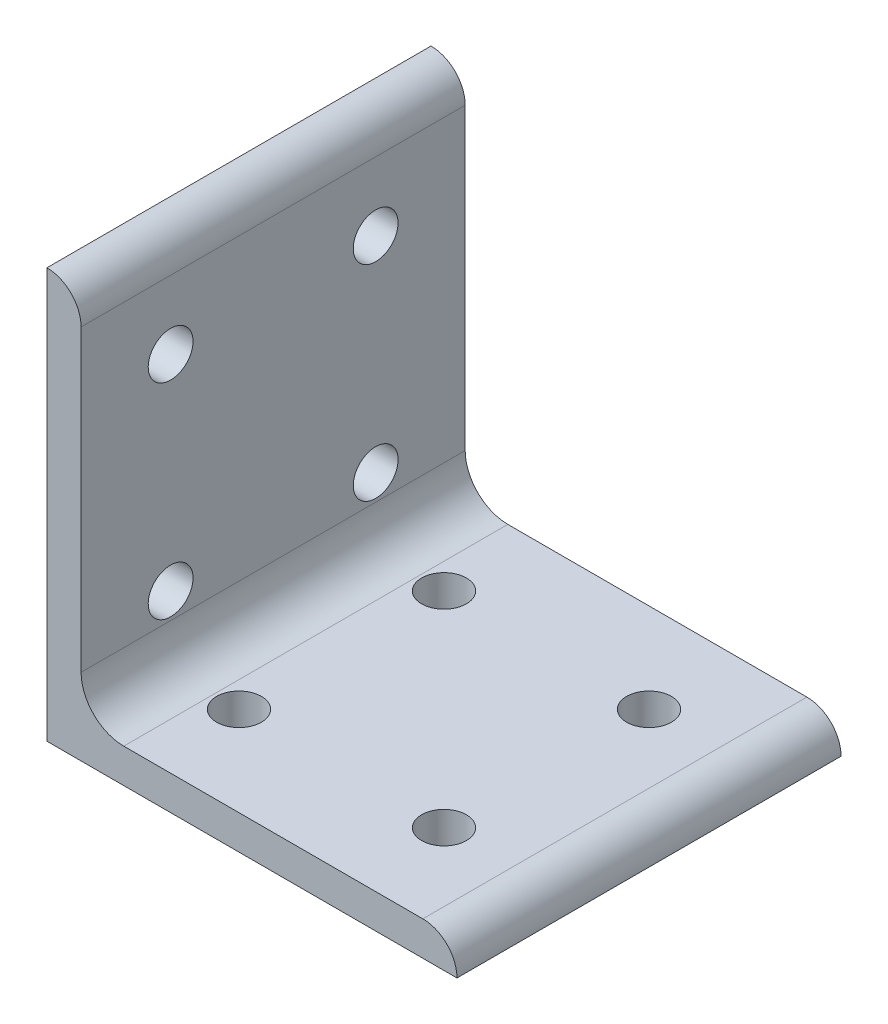
ISO-10303-21;
HEADER;
FILE_DESCRIPTION(('STEP AP214'),'2;1');
FILE_NAME('part.step','',(''),(''),'','','');
FILE_SCHEMA(('AUTOMOTIVE_DESIGN { 1 0 10303 214 1 1 1 1 }'));
ENDSEC;
DATA;
#1=APPLICATION_CONTEXT('core data for automotive mechanical design processes');
#2=APPLICATION_PROTOCOL_DEFINITION('international standard','automotive_design',2000,#1);
#3=PRODUCT_CONTEXT('',#1,'mechanical');
#4=PRODUCT('Part','Part','',(#3));
#5=PRODUCT_RELATED_PRODUCT_CATEGORY('part','',(#4));
#6=PRODUCT_DEFINITION_FORMATION('','',#4);
#7=PRODUCT_DEFINITION_CONTEXT('part definition',#1,'design');
#8=PRODUCT_DEFINITION('design','',#6,#7);
#9=PRODUCT_DEFINITION_SHAPE('','',#8);
#10=(LENGTH_UNIT() NAMED_UNIT(*) SI_UNIT(.MILLI.,.METRE.));
#11=(NAMED_UNIT(*) PLANE_ANGLE_UNIT() SI_UNIT($,.RADIAN.));
#12=(NAMED_UNIT(*) SI_UNIT($,.STERADIAN.) SOLID_ANGLE_UNIT());
#13=UNCERTAINTY_MEASURE_WITH_UNIT(LENGTH_MEASURE(1.E-05),#10,'distance_accuracy_value','');
#14=(GEOMETRIC_REPRESENTATION_CONTEXT(3) GLOBAL_UNCERTAINTY_ASSIGNED_CONTEXT((#13)) GLOBAL_UNIT_ASSIGNED_CONTEXT((#10,
#11,#12)) REPRESENTATION_CONTEXT('',''));
#15=CARTESIAN_POINT('',(0.,0.,0.));
#16=DIRECTION('',(0.,0.,1.));
#17=DIRECTION('',(1.,0.,0.));
#18=AXIS2_PLACEMENT_3D('',#15,#16,#17);
#19=CARTESIAN_POINT('',(6.35,69.85,35.687));
#20=DIRECTION('',(-1.,0.,0.));
#21=DIRECTION('',(0.,-1.,0.));
#22=AXIS2_PLACEMENT_3D('',#19,#20,#21);
#23=PLANE('',#22);
#24=DIRECTION('',(0.,1.,0.));
#25=VECTOR('',#24,1.);
#26=CARTESIAN_POINT('',(6.35,69.85,-35.687));
#27=LINE('',#26,#25);
#28=CARTESIAN_POINT('',(6.35,14.2748,-35.687));
#29=VERTEX_POINT('',#28);
#30=CARTESIAN_POINT('',(6.35,69.85,-35.687));
#31=VERTEX_POINT('',#30);
#32=EDGE_CURVE('E117',#29,#31,#27,.T.);
#33=ORIENTED_EDGE('',*,*,#32,.T.);
#34=DIRECTION('',(0.,0.,-1.));
#35=VECTOR('',#34,1.);
#36=CARTESIAN_POINT('',(6.35,69.85,35.687));
#37=LINE('',#36,#35);
#38=CARTESIAN_POINT('',(6.35,69.85,35.687));
#39=VERTEX_POINT('',#38);
#40=EDGE_CURVE('E114',#39,#31,#37,.T.);
#41=ORIENTED_EDGE('',*,*,#40,.F.);
#42=DIRECTION('',(0.,1.,0.));
#43=VECTOR('',#42,1.);
#44=CARTESIAN_POINT('',(6.35,69.85,35.687));
#45=LINE('',#44,#43);
#46=CARTESIAN_POINT('',(6.35,14.2748,35.687));
#47=VERTEX_POINT('',#46);
#48=EDGE_CURVE('E103',#47,#39,#45,.T.);
#49=ORIENTED_EDGE('',*,*,#48,.F.);
#50=DIRECTION('',(0.,0.,-1.));
#51=VECTOR('',#50,1.);
#52=CARTESIAN_POINT('',(6.35,14.2748,35.687));
#53=LINE('',#52,#51);
#54=EDGE_CURVE('E118',#47,#29,#53,.T.);
#55=ORIENTED_EDGE('',*,*,#54,.T.);
#56=EDGE_LOOP('',(#33,#41,#49,#55));
#57=FACE_BOUND('',#56,.T.);
#58=CARTESIAN_POINT('',(6.34999999999999,19.05,19.05));
#59=DIRECTION('',(-1.,0.,0.));
#60=DIRECTION('',(0.,-1.,0.));
#61=AXIS2_PLACEMENT_3D('',#58,#59,#60);
#62=CIRCLE('',#61,4.1656);
#63=CARTESIAN_POINT('',(6.35,14.8844,19.05));
#64=VERTEX_POINT('',#63);
#65=EDGE_CURVE('E225',#64,#64,#62,.F.);
#66=ORIENTED_EDGE('',*,*,#65,.F.);
#67=EDGE_LOOP('',(#66));
#68=FACE_BOUND('',#67,.T.);
#69=CARTESIAN_POINT('',(6.34999999999999,57.15,19.05));
#70=DIRECTION('',(-1.,0.,0.));
#71=DIRECTION('',(0.,-1.,0.));
#72=AXIS2_PLACEMENT_3D('',#69,#70,#71);
#73=CIRCLE('',#72,4.1656);
#74=CARTESIAN_POINT('',(6.35,52.9844,19.05));
#75=VERTEX_POINT('',#74);
#76=EDGE_CURVE('E222',#75,#75,#73,.F.);
#77=ORIENTED_EDGE('',*,*,#76,.F.);
#78=EDGE_LOOP('',(#77));
#79=FACE_BOUND('',#78,.T.);
#80=CARTESIAN_POINT('',(6.34999999999999,19.05,-19.05));
#81=DIRECTION('',(-1.,0.,0.));
#82=DIRECTION('',(0.,-1.,0.));
#83=AXIS2_PLACEMENT_3D('',#80,#81,#82);
#84=CIRCLE('',#83,4.1656);
#85=CARTESIAN_POINT('',(6.35,14.8844,-19.05));
#86=VERTEX_POINT('',#85);
#87=EDGE_CURVE('E218',#86,#86,#84,.F.);
#88=ORIENTED_EDGE('',*,*,#87,.F.);
#89=EDGE_LOOP('',(#88));
#90=FACE_BOUND('',#89,.T.);
#91=CARTESIAN_POINT('',(6.34999999999999,57.15,-19.05));
#92=DIRECTION('',(-1.,0.,0.));
#93=DIRECTION('',(0.,-1.,0.));
#94=AXIS2_PLACEMENT_3D('',#91,#92,#93);
#95=CIRCLE('',#94,4.1656);
#96=CARTESIAN_POINT('',(6.35,52.9844,-19.05));
#97=VERTEX_POINT('',#96);
#98=EDGE_CURVE('E212',#97,#97,#95,.F.);
#99=ORIENTED_EDGE('',*,*,#98,.F.);
#100=EDGE_LOOP('',(#99));
#101=FACE_BOUND('',#100,.T.);
#102=ADVANCED_FACE('F34',(#57,#68,#79,#90,#101),#23,.F.);
#103=CARTESIAN_POINT('',(0.,0.,35.687));
#104=DIRECTION('',(1.,0.,0.));
#105=DIRECTION('',(0.,0.,-1.));
#106=AXIS2_PLACEMENT_3D('',#103,#104,#105);
#107=PLANE('',#106);
#108=DIRECTION('',(0.,-1.,0.));
#109=VECTOR('',#108,1.);
#110=CARTESIAN_POINT('',(0.,0.,-35.687));
#111=LINE('',#110,#109);
#112=CARTESIAN_POINT('',(0.,76.2,-35.687));
#113=VERTEX_POINT('',#112);
#114=CARTESIAN_POINT('',(0.,0.,-35.687));
#115=VERTEX_POINT('',#114);
#116=EDGE_CURVE('E85',#113,#115,#111,.T.);
#117=ORIENTED_EDGE('',*,*,#116,.T.);
#118=DIRECTION('',(0.,0.,-1.));
#119=VECTOR('',#118,1.);
#120=CARTESIAN_POINT('',(0.,0.,35.687));
#121=LINE('',#120,#119);
#122=CARTESIAN_POINT('',(0.,0.,35.687));
#123=VERTEX_POINT('',#122);
#124=EDGE_CURVE('E123',#123,#115,#121,.T.);
#125=ORIENTED_EDGE('',*,*,#124,.F.);
#126=DIRECTION('',(0.,-1.,0.));
#127=VECTOR('',#126,1.);
#128=CARTESIAN_POINT('',(0.,0.,35.687));
#129=LINE('',#128,#127);
#130=CARTESIAN_POINT('',(0.,76.2,35.687));
#131=VERTEX_POINT('',#130);
#132=EDGE_CURVE('E53',#131,#123,#129,.T.);
#133=ORIENTED_EDGE('',*,*,#132,.F.);
#134=DIRECTION('',(0.,0.,-1.));
#135=VECTOR('',#134,1.);
#136=CARTESIAN_POINT('',(0.,76.2,35.687));
#137=LINE('',#136,#135);
#138=EDGE_CURVE('E119',#131,#113,#137,.T.);
#139=ORIENTED_EDGE('',*,*,#138,.T.);
#140=EDGE_LOOP('',(#117,#125,#133,#139));
#141=FACE_BOUND('',#140,.T.);
#142=CARTESIAN_POINT('',(0.,19.05,19.05));
#143=DIRECTION('',(1.,0.,0.));
#144=DIRECTION('',(0.,0.,-1.));
#145=AXIS2_PLACEMENT_3D('',#142,#143,#144);
#146=CIRCLE('',#145,4.1656);
#147=CARTESIAN_POINT('',(0.,19.05,14.8844));
#148=VERTEX_POINT('',#147);
#149=EDGE_CURVE('E199',#148,#148,#146,.T.);
#150=ORIENTED_EDGE('',*,*,#149,.T.);
#151=EDGE_LOOP('',(#150));
#152=FACE_BOUND('',#151,.T.);
#153=CARTESIAN_POINT('',(0.,57.15,19.05));
#154=DIRECTION('',(1.,0.,0.));
#155=DIRECTION('',(0.,0.,-1.));
#156=AXIS2_PLACEMENT_3D('',#153,#154,#155);
#157=CIRCLE('',#156,4.1656);
#158=CARTESIAN_POINT('',(0.,57.15,14.8844));
#159=VERTEX_POINT('',#158);
#160=EDGE_CURVE('E203',#159,#159,#157,.T.);
#161=ORIENTED_EDGE('',*,*,#160,.T.);
#162=EDGE_LOOP('',(#161));
#163=FACE_BOUND('',#162,.T.);
#164=CARTESIAN_POINT('',(0.,19.05,-19.05));
#165=DIRECTION('',(1.,0.,0.));
#166=DIRECTION('',(0.,0.,-1.));
#167=AXIS2_PLACEMENT_3D('',#164,#165,#166);
#168=CIRCLE('',#167,4.1656);
#169=CARTESIAN_POINT('',(0.,19.05,-23.2156));
#170=VERTEX_POINT('',#169);
#171=EDGE_CURVE('E207',#170,#170,#168,.T.);
#172=ORIENTED_EDGE('',*,*,#171,.T.);
#173=EDGE_LOOP('',(#172));
#174=FACE_BOUND('',#173,.T.);
#175=CARTESIAN_POINT('',(0.,57.15,-19.05));
#176=DIRECTION('',(1.,0.,0.));
#177=DIRECTION('',(0.,0.,-1.));
#178=AXIS2_PLACEMENT_3D('',#175,#176,#177);
#179=CIRCLE('',#178,4.1656);
#180=CARTESIAN_POINT('',(0.,57.15,-23.2156));
#181=VERTEX_POINT('',#180);
#182=EDGE_CURVE('E210',#181,#181,#179,.T.);
#183=ORIENTED_EDGE('',*,*,#182,.T.);
#184=EDGE_LOOP('',(#183));
#185=FACE_BOUND('',#184,.T.);
#186=ADVANCED_FACE('F192',(#141,#152,#163,#174,#185),#107,.F.);
#187=CARTESIAN_POINT('',(76.2,0.,35.687));
#188=DIRECTION('',(0.,1.,0.));
#189=DIRECTION('',(-1.,0.,0.));
#190=AXIS2_PLACEMENT_3D('',#187,#188,#189);
#191=PLANE('',#190);
#192=DIRECTION('',(1.,0.,0.));
#193=VECTOR('',#192,1.);
#194=CARTESIAN_POINT('',(76.2,0.,-35.687));
#195=LINE('',#194,#193);
#196=CARTESIAN_POINT('',(76.2,0.,-35.687));
#197=VERTEX_POINT('',#196);
#198=EDGE_CURVE('E127',#115,#197,#195,.T.);
#199=ORIENTED_EDGE('',*,*,#198,.T.);
#200=DIRECTION('',(0.,0.,-1.));
#201=VECTOR('',#200,1.);
#202=CARTESIAN_POINT('',(76.2,0.,35.687));
#203=LINE('',#202,#201);
#204=CARTESIAN_POINT('',(76.2,0.,35.687));
#205=VERTEX_POINT('',#204);
#206=EDGE_CURVE('E11',#205,#197,#203,.T.);
#207=ORIENTED_EDGE('',*,*,#206,.F.);
#208=DIRECTION('',(1.,0.,0.));
#209=VECTOR('',#208,1.);
#210=CARTESIAN_POINT('',(76.2,0.,35.687));
#211=LINE('',#210,#209);
#212=EDGE_CURVE('E140',#123,#205,#211,.T.);
#213=ORIENTED_EDGE('',*,*,#212,.F.);
#214=ORIENTED_EDGE('',*,*,#124,.T.);
#215=EDGE_LOOP('',(#199,#207,#213,#214));
#216=FACE_BOUND('',#215,.T.);
#217=CARTESIAN_POINT('',(19.05,0.,19.05));
#218=DIRECTION('',(0.,1.,0.));
#219=DIRECTION('',(0.,0.,1.));
#220=AXIS2_PLACEMENT_3D('',#217,#218,#219);
#221=CIRCLE('',#220,4.1656);
#222=CARTESIAN_POINT('',(19.05,0.,23.2156));
#223=VERTEX_POINT('',#222);
#224=EDGE_CURVE('E151',#223,#223,#221,.T.);
#225=ORIENTED_EDGE('',*,*,#224,.T.);
#226=EDGE_LOOP('',(#225));
#227=FACE_BOUND('',#226,.T.);
#228=CARTESIAN_POINT('',(57.15,0.,19.05));
#229=DIRECTION('',(0.,1.,0.));
#230=DIRECTION('',(0.,0.,1.));
#231=AXIS2_PLACEMENT_3D('',#228,#229,#230);
#232=CIRCLE('',#231,4.1656);
#233=CARTESIAN_POINT('',(57.15,0.,23.2156));
#234=VERTEX_POINT('',#233);
#235=EDGE_CURVE('E154',#234,#234,#232,.T.);
#236=ORIENTED_EDGE('',*,*,#235,.T.);
#237=EDGE_LOOP('',(#236));
#238=FACE_BOUND('',#237,.T.);
#239=CARTESIAN_POINT('',(19.05,0.,-19.05));
#240=DIRECTION('',(0.,1.,0.));
#241=DIRECTION('',(0.,0.,1.));
#242=AXIS2_PLACEMENT_3D('',#239,#240,#241);
#243=CIRCLE('',#242,4.1656);
#244=CARTESIAN_POINT('',(19.05,0.,-14.8844));
#245=VERTEX_POINT('',#244);
#246=EDGE_CURVE('E157',#245,#245,#243,.T.);
#247=ORIENTED_EDGE('',*,*,#246,.T.);
#248=EDGE_LOOP('',(#247));
#249=FACE_BOUND('',#248,.T.);
#250=CARTESIAN_POINT('',(57.15,0.,-19.05));
#251=DIRECTION('',(0.,1.,0.));
#252=DIRECTION('',(0.,0.,1.));
#253=AXIS2_PLACEMENT_3D('',#250,#251,#252);
#254=CIRCLE('',#253,4.1656);
#255=CARTESIAN_POINT('',(57.15,0.,-14.8844));
#256=VERTEX_POINT('',#255);
#257=EDGE_CURVE('E167',#256,#256,#254,.T.);
#258=ORIENTED_EDGE('',*,*,#257,.T.);
#259=EDGE_LOOP('',(#258));
#260=FACE_BOUND('',#259,.T.);
#261=ADVANCED_FACE('F36',(#216,#227,#238,#249,#260),#191,.F.);
#262=CARTESIAN_POINT('',(14.2748,6.35,35.687));
#263=DIRECTION('',(0.,-1.,0.));
#264=DIRECTION('',(1.,0.,0.));
#265=AXIS2_PLACEMENT_3D('',#262,#263,#264);
#266=PLANE('',#265);
#267=DIRECTION('',(-1.,0.,0.));
#268=VECTOR('',#267,1.);
#269=CARTESIAN_POINT('',(14.2748,6.35,-35.687));
#270=LINE('',#269,#268);
#271=CARTESIAN_POINT('',(69.85,6.35,-35.687));
#272=VERTEX_POINT('',#271);
#273=CARTESIAN_POINT('',(14.2748,6.35,-35.687));
#274=VERTEX_POINT('',#273);
#275=EDGE_CURVE('E133',#272,#274,#270,.T.);
#276=ORIENTED_EDGE('',*,*,#275,.T.);
#277=DIRECTION('',(0.,0.,-1.));
#278=VECTOR('',#277,1.);
#279=CARTESIAN_POINT('',(14.2748,6.35,35.687));
#280=LINE('',#279,#278);
#281=CARTESIAN_POINT('',(14.2748,6.35,35.687));
#282=VERTEX_POINT('',#281);
#283=EDGE_CURVE('E144',#282,#274,#280,.T.);
#284=ORIENTED_EDGE('',*,*,#283,.F.);
#285=DIRECTION('',(-1.,0.,0.));
#286=VECTOR('',#285,1.);
#287=CARTESIAN_POINT('',(14.2748,6.35,35.687));
#288=LINE('',#287,#286);
#289=CARTESIAN_POINT('',(69.85,6.35,35.687));
#290=VERTEX_POINT('',#289);
#291=EDGE_CURVE('E175',#290,#282,#288,.T.);
#292=ORIENTED_EDGE('',*,*,#291,.F.);
#293=DIRECTION('',(0.,0.,-1.));
#294=VECTOR('',#293,1.);
#295=CARTESIAN_POINT('',(69.85,6.35,35.687));
#296=LINE('',#295,#294);
#297=EDGE_CURVE('E44',#290,#272,#296,.T.);
#298=ORIENTED_EDGE('',*,*,#297,.T.);
#299=EDGE_LOOP('',(#276,#284,#292,#298));
#300=FACE_BOUND('',#299,.T.);
#301=CARTESIAN_POINT('',(19.05,6.35000000000001,19.05));
#302=DIRECTION('',(0.,-1.,0.));
#303=DIRECTION('',(1.,0.,0.));
#304=AXIS2_PLACEMENT_3D('',#301,#302,#303);
#305=CIRCLE('',#304,4.1656);
#306=CARTESIAN_POINT('',(23.2156,6.35000000000001,19.05));
#307=VERTEX_POINT('',#306);
#308=EDGE_CURVE('E131',#307,#307,#305,.F.);
#309=ORIENTED_EDGE('',*,*,#308,.F.);
#310=EDGE_LOOP('',(#309));
#311=FACE_BOUND('',#310,.T.);
#312=CARTESIAN_POINT('',(57.15,6.35000000000001,19.05));
#313=DIRECTION('',(0.,-1.,0.));
#314=DIRECTION('',(1.,0.,0.));
#315=AXIS2_PLACEMENT_3D('',#312,#313,#314);
#316=CIRCLE('',#315,4.1656);
#317=CARTESIAN_POINT('',(61.3156,6.35000000000001,19.05));
#318=VERTEX_POINT('',#317);
#319=EDGE_CURVE('E152',#318,#318,#316,.F.);
#320=ORIENTED_EDGE('',*,*,#319,.F.);
#321=EDGE_LOOP('',(#320));
#322=FACE_BOUND('',#321,.T.);
#323=CARTESIAN_POINT('',(19.05,6.35000000000001,-19.05));
#324=DIRECTION('',(0.,-1.,0.));
#325=DIRECTION('',(1.,0.,0.));
#326=AXIS2_PLACEMENT_3D('',#323,#324,#325);
#327=CIRCLE('',#326,4.1656);
#328=CARTESIAN_POINT('',(23.2156,6.35000000000001,-19.05));
#329=VERTEX_POINT('',#328);
#330=EDGE_CURVE('E155',#329,#329,#327,.F.);
#331=ORIENTED_EDGE('',*,*,#330,.F.);
#332=EDGE_LOOP('',(#331));
#333=FACE_BOUND('',#332,.T.);
#334=CARTESIAN_POINT('',(57.15,6.35000000000001,-19.05));
#335=DIRECTION('',(0.,-1.,0.));
#336=DIRECTION('',(1.,0.,0.));
#337=AXIS2_PLACEMENT_3D('',#334,#335,#336);
#338=CIRCLE('',#337,4.1656);
#339=CARTESIAN_POINT('',(61.3156,6.35000000000001,-19.05));
#340=VERTEX_POINT('',#339);
#341=EDGE_CURVE('E38',#340,#340,#338,.F.);
#342=ORIENTED_EDGE('',*,*,#341,.F.);
#343=EDGE_LOOP('',(#342));
#344=FACE_BOUND('',#343,.T.);
#345=ADVANCED_FACE('F179',(#300,#311,#322,#333,#344),#266,.F.);
#346=CARTESIAN_POINT('',(69.85,0.,35.687));
#347=DIRECTION('',(0.,0.,-1.));
#348=DIRECTION('',(-1.,0.,0.));
#349=AXIS2_PLACEMENT_3D('',#346,#347,#348);
#350=CYLINDRICAL_SURFACE('',#349,6.35000000000001);
#351=CARTESIAN_POINT('',(69.85,0.,-35.687));
#352=DIRECTION('',(0.,0.,1.));
#353=DIRECTION('',(1.,0.,0.));
#354=AXIS2_PLACEMENT_3D('',#351,#352,#353);
#355=CIRCLE('',#354,6.35000000000001);
#356=EDGE_CURVE('E130',#197,#272,#355,.T.);
#357=ORIENTED_EDGE('',*,*,#356,.T.);
#358=ORIENTED_EDGE('',*,*,#297,.F.);
#359=CARTESIAN_POINT('',(69.85,0.,35.687));
#360=DIRECTION('',(0.,0.,1.));
#361=DIRECTION('',(1.,0.,0.));
#362=AXIS2_PLACEMENT_3D('',#359,#360,#361);
#363=CIRCLE('',#362,6.35000000000001);
#364=EDGE_CURVE('E93',#205,#290,#363,.T.);
#365=ORIENTED_EDGE('',*,*,#364,.F.);
#366=ORIENTED_EDGE('',*,*,#206,.T.);
#367=EDGE_LOOP('',(#357,#358,#365,#366));
#368=FACE_BOUND('',#367,.T.);
#369=ADVANCED_FACE('F242',(#368),#350,.T.);
#370=CARTESIAN_POINT('',(14.2748,14.2748,35.687));
#371=DIRECTION('',(0.,0.,-1.));
#372=DIRECTION('',(-1.,0.,0.));
#373=AXIS2_PLACEMENT_3D('',#370,#371,#372);
#374=CYLINDRICAL_SURFACE('',#373,7.9248);
#375=CARTESIAN_POINT('',(14.2748,14.2748,-35.687));
#376=DIRECTION('',(0.,0.,-1.));
#377=DIRECTION('',(1.,0.,0.));
#378=AXIS2_PLACEMENT_3D('',#375,#376,#377);
#379=CIRCLE('',#378,7.9248);
#380=EDGE_CURVE('E135',#274,#29,#379,.T.);
#381=ORIENTED_EDGE('',*,*,#380,.T.);
#382=ORIENTED_EDGE('',*,*,#54,.F.);
#383=CARTESIAN_POINT('',(14.2748,14.2748,35.687));
#384=DIRECTION('',(0.,0.,-1.));
#385=DIRECTION('',(1.,0.,0.));
#386=AXIS2_PLACEMENT_3D('',#383,#384,#385);
#387=CIRCLE('',#386,7.9248);
#388=EDGE_CURVE('E109',#282,#47,#387,.T.);
#389=ORIENTED_EDGE('',*,*,#388,.F.);
#390=ORIENTED_EDGE('',*,*,#283,.T.);
#391=EDGE_LOOP('',(#381,#382,#389,#390));
#392=FACE_BOUND('',#391,.T.);
#393=ADVANCED_FACE('F184',(#392),#374,.F.);
#394=CARTESIAN_POINT('',(0.,69.85,35.687));
#395=DIRECTION('',(0.,0.,-1.));
#396=DIRECTION('',(-1.,0.,0.));
#397=AXIS2_PLACEMENT_3D('',#394,#395,#396);
#398=CYLINDRICAL_SURFACE('',#397,6.35000000000001);
#399=CARTESIAN_POINT('',(0.,69.85,-35.687));
#400=DIRECTION('',(0.,0.,1.));
#401=DIRECTION('',(1.,0.,0.));
#402=AXIS2_PLACEMENT_3D('',#399,#400,#401);
#403=CIRCLE('',#402,6.35000000000001);
#404=EDGE_CURVE('E79',#31,#113,#403,.T.);
#405=ORIENTED_EDGE('',*,*,#404,.T.);
#406=ORIENTED_EDGE('',*,*,#138,.F.);
#407=CARTESIAN_POINT('',(0.,69.85,35.687));
#408=DIRECTION('',(0.,0.,1.));
#409=DIRECTION('',(1.,0.,0.));
#410=AXIS2_PLACEMENT_3D('',#407,#408,#409);
#411=CIRCLE('',#410,6.35000000000001);
#412=EDGE_CURVE('E107',#39,#131,#411,.T.);
#413=ORIENTED_EDGE('',*,*,#412,.F.);
#414=ORIENTED_EDGE('',*,*,#40,.T.);
#415=EDGE_LOOP('',(#405,#406,#413,#414));
#416=FACE_BOUND('',#415,.T.);
#417=ADVANCED_FACE('F121',(#416),#398,.T.);
#418=CARTESIAN_POINT('',(0.,69.85,35.687));
#419=DIRECTION('',(0.,0.,1.));
#420=DIRECTION('',(1.,0.,0.));
#421=AXIS2_PLACEMENT_3D('',#418,#419,#420);
#422=PLANE('',#421);
#423=ORIENTED_EDGE('',*,*,#212,.T.);
#424=ORIENTED_EDGE('',*,*,#364,.T.);
#425=ORIENTED_EDGE('',*,*,#291,.T.);
#426=ORIENTED_EDGE('',*,*,#388,.T.);
#427=ORIENTED_EDGE('',*,*,#48,.T.);
#428=ORIENTED_EDGE('',*,*,#412,.T.);
#429=ORIENTED_EDGE('',*,*,#132,.T.);
#430=EDGE_LOOP('',(#423,#424,#425,#426,#427,#428,#429));
#431=FACE_BOUND('',#430,.T.);
#432=ADVANCED_FACE('F105',(#431),#422,.T.);
#433=CARTESIAN_POINT('',(0.,69.85,-35.687));
#434=DIRECTION('',(0.,0.,1.));
#435=DIRECTION('',(1.,0.,0.));
#436=AXIS2_PLACEMENT_3D('',#433,#434,#435);
#437=PLANE('',#436);
#438=ORIENTED_EDGE('',*,*,#198,.F.);
#439=ORIENTED_EDGE('',*,*,#116,.F.);
#440=ORIENTED_EDGE('',*,*,#404,.F.);
#441=ORIENTED_EDGE('',*,*,#32,.F.);
#442=ORIENTED_EDGE('',*,*,#380,.F.);
#443=ORIENTED_EDGE('',*,*,#275,.F.);
#444=ORIENTED_EDGE('',*,*,#356,.F.);
#445=EDGE_LOOP('',(#438,#439,#440,#441,#442,#443,#444));
#446=FACE_BOUND('',#445,.T.);
#447=ADVANCED_FACE('F187',(#446),#437,.F.);
#448=CARTESIAN_POINT('',(19.05,76.2,19.05));
#449=DIRECTION('',(0.,-1.,0.));
#450=DIRECTION('',(0.,0.,-1.));
#451=AXIS2_PLACEMENT_3D('',#448,#449,#450);
#452=CYLINDRICAL_SURFACE('',#451,4.1656);
#453=ORIENTED_EDGE('',*,*,#224,.F.);
#454=EDGE_LOOP('',(#453));
#455=FACE_BOUND('',#454,.T.);
#456=ORIENTED_EDGE('',*,*,#308,.T.);
#457=EDGE_LOOP('',(#456));
#458=FACE_BOUND('',#457,.T.);
#459=ADVANCED_FACE('F265',(#455,#458),#452,.F.);
#460=CARTESIAN_POINT('',(57.15,76.2,19.05));
#461=DIRECTION('',(0.,-1.,0.));
#462=DIRECTION('',(0.,0.,-1.));
#463=AXIS2_PLACEMENT_3D('',#460,#461,#462);
#464=CYLINDRICAL_SURFACE('',#463,4.1656);
#465=ORIENTED_EDGE('',*,*,#235,.F.);
#466=EDGE_LOOP('',(#465));
#467=FACE_BOUND('',#466,.T.);
#468=ORIENTED_EDGE('',*,*,#319,.T.);
#469=EDGE_LOOP('',(#468));
#470=FACE_BOUND('',#469,.T.);
#471=ADVANCED_FACE('F270',(#467,#470),#464,.F.);
#472=CARTESIAN_POINT('',(19.05,76.2,-19.05));
#473=DIRECTION('',(0.,-1.,0.));
#474=DIRECTION('',(0.,0.,-1.));
#475=AXIS2_PLACEMENT_3D('',#472,#473,#474);
#476=CYLINDRICAL_SURFACE('',#475,4.1656);
#477=ORIENTED_EDGE('',*,*,#246,.F.);
#478=EDGE_LOOP('',(#477));
#479=FACE_BOUND('',#478,.T.);
#480=ORIENTED_EDGE('',*,*,#330,.T.);
#481=EDGE_LOOP('',(#480));
#482=FACE_BOUND('',#481,.T.);
#483=ADVANCED_FACE('F237',(#479,#482),#476,.F.);
#484=CARTESIAN_POINT('',(57.15,76.2,-19.05));
#485=DIRECTION('',(0.,-1.,0.));
#486=DIRECTION('',(0.,0.,-1.));
#487=AXIS2_PLACEMENT_3D('',#484,#485,#486);
#488=CYLINDRICAL_SURFACE('',#487,4.1656);
#489=ORIENTED_EDGE('',*,*,#257,.F.);
#490=EDGE_LOOP('',(#489));
#491=FACE_BOUND('',#490,.T.);
#492=ORIENTED_EDGE('',*,*,#341,.T.);
#493=EDGE_LOOP('',(#492));
#494=FACE_BOUND('',#493,.T.);
#495=ADVANCED_FACE('F233',(#491,#494),#488,.F.);
#496=CARTESIAN_POINT('',(76.2,19.05,19.05));
#497=DIRECTION('',(-1.,0.,0.));
#498=DIRECTION('',(0.,0.,1.));
#499=AXIS2_PLACEMENT_3D('',#496,#497,#498);
#500=CYLINDRICAL_SURFACE('',#499,4.1656);
#501=ORIENTED_EDGE('',*,*,#149,.F.);
#502=EDGE_LOOP('',(#501));
#503=FACE_BOUND('',#502,.T.);
#504=ORIENTED_EDGE('',*,*,#65,.T.);
#505=EDGE_LOOP('',(#504));
#506=FACE_BOUND('',#505,.T.);
#507=ADVANCED_FACE('F236',(#503,#506),#500,.F.);
#508=CARTESIAN_POINT('',(76.2,57.15,19.05));
#509=DIRECTION('',(-1.,0.,0.));
#510=DIRECTION('',(0.,0.,1.));
#511=AXIS2_PLACEMENT_3D('',#508,#509,#510);
#512=CYLINDRICAL_SURFACE('',#511,4.1656);
#513=ORIENTED_EDGE('',*,*,#160,.F.);
#514=EDGE_LOOP('',(#513));
#515=FACE_BOUND('',#514,.T.);
#516=ORIENTED_EDGE('',*,*,#76,.T.);
#517=EDGE_LOOP('',(#516));
#518=FACE_BOUND('',#517,.T.);
#519=ADVANCED_FACE('F280',(#515,#518),#512,.F.);
#520=CARTESIAN_POINT('',(76.2,19.05,-19.05));
#521=DIRECTION('',(-1.,0.,0.));
#522=DIRECTION('',(0.,0.,1.));
#523=AXIS2_PLACEMENT_3D('',#520,#521,#522);
#524=CYLINDRICAL_SURFACE('',#523,4.1656);
#525=ORIENTED_EDGE('',*,*,#171,.F.);
#526=EDGE_LOOP('',(#525));
#527=FACE_BOUND('',#526,.T.);
#528=ORIENTED_EDGE('',*,*,#87,.T.);
#529=EDGE_LOOP('',(#528));
#530=FACE_BOUND('',#529,.T.);
#531=ADVANCED_FACE('F284',(#527,#530),#524,.F.);
#532=CARTESIAN_POINT('',(76.2,57.15,-19.05));
#533=DIRECTION('',(-1.,0.,0.));
#534=DIRECTION('',(0.,0.,1.));
#535=AXIS2_PLACEMENT_3D('',#532,#533,#534);
#536=CYLINDRICAL_SURFACE('',#535,4.1656);
#537=ORIENTED_EDGE('',*,*,#182,.F.);
#538=EDGE_LOOP('',(#537));
#539=FACE_BOUND('',#538,.T.);
#540=ORIENTED_EDGE('',*,*,#98,.T.);
#541=EDGE_LOOP('',(#540));
#542=FACE_BOUND('',#541,.T.);
#543=ADVANCED_FACE('F288',(#539,#542),#536,.F.);
#544=CLOSED_SHELL('',(#102,#186,#261,#345,#369,#393,#417,#432,#447,#459,#471,#483,#495,#507,
#519,#531,#543));
#545=MANIFOLD_SOLID_BREP('B2',#544);
#546=ADVANCED_BREP_SHAPE_REPRESENTATION('',(#18,#545),#14);
#547=SHAPE_DEFINITION_REPRESENTATION(#9,#546);
ENDSEC;
END-ISO-10303-21;
